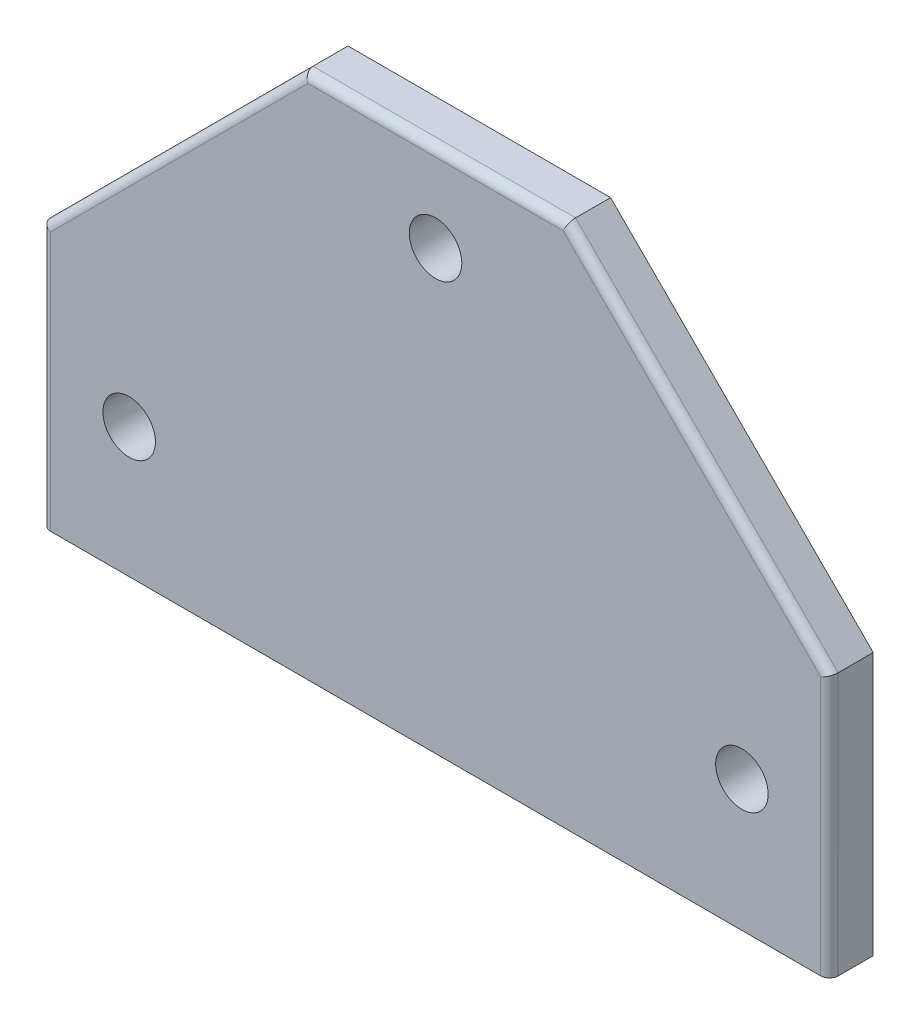
ISO-10303-21;
HEADER;
FILE_DESCRIPTION(('STEP AP214'),'2;1');
FILE_NAME('part.step','',(''),(''),'','','');
FILE_SCHEMA(('AUTOMOTIVE_DESIGN { 1 0 10303 214 1 1 1 1 }'));
ENDSEC;
DATA;
#1=APPLICATION_CONTEXT('core data for automotive mechanical design processes');
#2=APPLICATION_PROTOCOL_DEFINITION('international standard','automotive_design',2000,#1);
#3=PRODUCT_CONTEXT('',#1,'mechanical');
#4=PRODUCT('Part','Part','',(#3));
#5=PRODUCT_RELATED_PRODUCT_CATEGORY('part','',(#4));
#6=PRODUCT_DEFINITION_FORMATION('','',#4);
#7=PRODUCT_DEFINITION_CONTEXT('part definition',#1,'design');
#8=PRODUCT_DEFINITION('design','',#6,#7);
#9=PRODUCT_DEFINITION_SHAPE('','',#8);
#10=(LENGTH_UNIT() NAMED_UNIT(*) SI_UNIT(.MILLI.,.METRE.));
#11=(NAMED_UNIT(*) PLANE_ANGLE_UNIT() SI_UNIT($,.RADIAN.));
#12=(NAMED_UNIT(*) SI_UNIT($,.STERADIAN.) SOLID_ANGLE_UNIT());
#13=UNCERTAINTY_MEASURE_WITH_UNIT(LENGTH_MEASURE(1.E-05),#10,'distance_accuracy_value','');
#14=(GEOMETRIC_REPRESENTATION_CONTEXT(3) GLOBAL_UNCERTAINTY_ASSIGNED_CONTEXT((#13)) GLOBAL_UNIT_ASSIGNED_CONTEXT((#10,
#11,#12)) REPRESENTATION_CONTEXT('',''));
#15=CARTESIAN_POINT('',(0.,0.,0.));
#16=DIRECTION('',(0.,0.,1.));
#17=DIRECTION('',(1.,0.,0.));
#18=AXIS2_PLACEMENT_3D('',#15,#16,#17);
#19=CARTESIAN_POINT('',(0.,0.,6.35));
#20=DIRECTION('',(1.,0.,0.));
#21=DIRECTION('',(0.,0.,-1.));
#22=AXIS2_PLACEMENT_3D('',#19,#20,#21);
#23=PLANE('',#22);
#24=DIRECTION('',(0.,0.,-1.));
#25=VECTOR('',#24,1.);
#26=CARTESIAN_POINT('',(0.,0.,6.35));
#27=LINE('',#26,#25);
#28=CARTESIAN_POINT('',(0.,0.,5.08));
#29=VERTEX_POINT('',#28);
#30=CARTESIAN_POINT('',(0.,0.,0.));
#31=VERTEX_POINT('',#30);
#32=EDGE_CURVE('E112',#29,#31,#27,.T.);
#33=ORIENTED_EDGE('',*,*,#32,.F.);
#34=DIRECTION('',(0.,-1.,0.));
#35=VECTOR('',#34,1.);
#36=CARTESIAN_POINT('',(0.,0.,5.08));
#37=LINE('',#36,#35);
#38=CARTESIAN_POINT('',(0.,38.1,5.08));
#39=VERTEX_POINT('',#38);
#40=EDGE_CURVE('E65',#29,#39,#37,.F.);
#41=ORIENTED_EDGE('',*,*,#40,.T.);
#42=DIRECTION('',(0.,0.,-1.));
#43=VECTOR('',#42,1.);
#44=CARTESIAN_POINT('',(0.,38.1,6.35));
#45=LINE('',#44,#43);
#46=CARTESIAN_POINT('',(0.,38.1,0.));
#47=VERTEX_POINT('',#46);
#48=EDGE_CURVE('E134',#39,#47,#45,.T.);
#49=ORIENTED_EDGE('',*,*,#48,.T.);
#50=DIRECTION('',(0.,-1.,0.));
#51=VECTOR('',#50,1.);
#52=CARTESIAN_POINT('',(0.,0.,0.));
#53=LINE('',#52,#51);
#54=EDGE_CURVE('E129',#47,#31,#53,.T.);
#55=ORIENTED_EDGE('',*,*,#54,.T.);
#56=EDGE_LOOP('',(#33,#41,#49,#55));
#57=FACE_BOUND('',#56,.T.);
#58=ADVANCED_FACE('F41',(#57),#23,.F.);
#59=CARTESIAN_POINT('',(0.,0.,6.35));
#60=DIRECTION('',(0.,1.,0.));
#61=DIRECTION('',(0.,0.,1.));
#62=AXIS2_PLACEMENT_3D('',#59,#60,#61);
#63=PLANE('',#62);
#64=DIRECTION('',(0.,0.,-1.));
#65=VECTOR('',#64,1.);
#66=CARTESIAN_POINT('',(114.3,0.,6.35));
#67=LINE('',#66,#65);
#68=CARTESIAN_POINT('',(114.3,0.,5.08));
#69=VERTEX_POINT('',#68);
#70=CARTESIAN_POINT('',(114.3,0.,0.));
#71=VERTEX_POINT('',#70);
#72=EDGE_CURVE('E123',#69,#71,#67,.T.);
#73=ORIENTED_EDGE('',*,*,#72,.F.);
#74=CARTESIAN_POINT('',(113.03,0.,5.08));
#75=DIRECTION('',(0.,1.,0.));
#76=DIRECTION('',(0.,0.,1.));
#77=AXIS2_PLACEMENT_3D('',#74,#75,#76);
#78=CIRCLE('',#77,1.27);
#79=CARTESIAN_POINT('',(113.03,0.,6.35));
#80=VERTEX_POINT('',#79);
#81=EDGE_CURVE('E173',#69,#80,#78,.F.);
#82=ORIENTED_EDGE('',*,*,#81,.T.);
#83=DIRECTION('',(1.,0.,0.));
#84=VECTOR('',#83,1.);
#85=CARTESIAN_POINT('',(0.,0.,6.35));
#86=LINE('',#85,#84);
#87=CARTESIAN_POINT('',(1.27,0.,6.35));
#88=VERTEX_POINT('',#87);
#89=EDGE_CURVE('E140',#88,#80,#86,.T.);
#90=ORIENTED_EDGE('',*,*,#89,.F.);
#91=CARTESIAN_POINT('',(1.27,0.,5.08));
#92=DIRECTION('',(0.,1.,0.));
#93=DIRECTION('',(0.,0.,1.));
#94=AXIS2_PLACEMENT_3D('',#91,#92,#93);
#95=CIRCLE('',#94,1.27);
#96=EDGE_CURVE('E120',#88,#29,#95,.F.);
#97=ORIENTED_EDGE('',*,*,#96,.T.);
#98=ORIENTED_EDGE('',*,*,#32,.T.);
#99=DIRECTION('',(1.,0.,0.));
#100=VECTOR('',#99,1.);
#101=CARTESIAN_POINT('',(0.,0.,0.));
#102=LINE('',#101,#100);
#103=EDGE_CURVE('E116',#31,#71,#102,.T.);
#104=ORIENTED_EDGE('',*,*,#103,.T.);
#105=EDGE_LOOP('',(#73,#82,#90,#97,#98,#104));
#106=FACE_BOUND('',#105,.T.);
#107=ADVANCED_FACE('F115',(#106),#63,.F.);
#108=CARTESIAN_POINT('',(114.3,0.,6.35));
#109=DIRECTION('',(-1.,0.,0.));
#110=DIRECTION('',(0.,0.,1.));
#111=AXIS2_PLACEMENT_3D('',#108,#109,#110);
#112=PLANE('',#111);
#113=DIRECTION('',(0.,0.,-1.));
#114=VECTOR('',#113,1.);
#115=CARTESIAN_POINT('',(114.3,38.1,6.35));
#116=LINE('',#115,#114);
#117=CARTESIAN_POINT('',(114.3,38.1,5.08));
#118=VERTEX_POINT('',#117);
#119=CARTESIAN_POINT('',(114.3,38.1,0.));
#120=VERTEX_POINT('',#119);
#121=EDGE_CURVE('E157',#118,#120,#116,.T.);
#122=ORIENTED_EDGE('',*,*,#121,.F.);
#123=DIRECTION('',(0.,1.,0.));
#124=VECTOR('',#123,1.);
#125=CARTESIAN_POINT('',(114.3,0.,5.08));
#126=LINE('',#125,#124);
#127=EDGE_CURVE('E170',#118,#69,#126,.F.);
#128=ORIENTED_EDGE('',*,*,#127,.T.);
#129=ORIENTED_EDGE('',*,*,#72,.T.);
#130=DIRECTION('',(0.,1.,0.));
#131=VECTOR('',#130,1.);
#132=CARTESIAN_POINT('',(114.3,0.,0.));
#133=LINE('',#132,#131);
#134=EDGE_CURVE('E132',#71,#120,#133,.T.);
#135=ORIENTED_EDGE('',*,*,#134,.T.);
#136=EDGE_LOOP('',(#122,#128,#129,#135));
#137=FACE_BOUND('',#136,.T.);
#138=ADVANCED_FACE('F213',(#137),#112,.F.);
#139=CARTESIAN_POINT('',(76.2,76.2,6.35));
#140=DIRECTION('',(-0.707106781186548,-0.707106781186547,0.));
#141=DIRECTION('',(0.707106781186547,-0.707106781186548,0.));
#142=AXIS2_PLACEMENT_3D('',#139,#140,#141);
#143=PLANE('',#142);
#144=DIRECTION('',(0.,0.,-1.));
#145=VECTOR('',#144,1.);
#146=CARTESIAN_POINT('',(76.2,76.2,6.35));
#147=LINE('',#146,#145);
#148=CARTESIAN_POINT('',(76.2,76.2,5.08));
#149=VERTEX_POINT('',#148);
#150=CARTESIAN_POINT('',(76.2,76.2,0.));
#151=VERTEX_POINT('',#150);
#152=EDGE_CURVE('E155',#149,#151,#147,.T.);
#153=ORIENTED_EDGE('',*,*,#152,.F.);
#154=DIRECTION('',(-0.707106781186547,0.707106781186548,0.));
#155=VECTOR('',#154,1.);
#156=CARTESIAN_POINT('',(76.2,76.2,5.08));
#157=LINE('',#156,#155);
#158=EDGE_CURVE('E175',#149,#118,#157,.F.);
#159=ORIENTED_EDGE('',*,*,#158,.T.);
#160=ORIENTED_EDGE('',*,*,#121,.T.);
#161=DIRECTION('',(-0.707106781186547,0.707106781186548,0.));
#162=VECTOR('',#161,1.);
#163=CARTESIAN_POINT('',(76.2,76.2,0.));
#164=LINE('',#163,#162);
#165=EDGE_CURVE('E144',#120,#151,#164,.T.);
#166=ORIENTED_EDGE('',*,*,#165,.T.);
#167=EDGE_LOOP('',(#153,#159,#160,#166));
#168=FACE_BOUND('',#167,.T.);
#169=ADVANCED_FACE('F312',(#168),#143,.F.);
#170=CARTESIAN_POINT('',(38.1,76.2,6.35));
#171=DIRECTION('',(0.,-1.,0.));
#172=DIRECTION('',(0.,0.,-1.));
#173=AXIS2_PLACEMENT_3D('',#170,#171,#172);
#174=PLANE('',#173);
#175=DIRECTION('',(0.,0.,-1.));
#176=VECTOR('',#175,1.);
#177=CARTESIAN_POINT('',(38.1,76.2,6.35));
#178=LINE('',#177,#176);
#179=CARTESIAN_POINT('',(38.1,76.2,5.08));
#180=VERTEX_POINT('',#179);
#181=CARTESIAN_POINT('',(38.1,76.2,0.));
#182=VERTEX_POINT('',#181);
#183=EDGE_CURVE('E153',#180,#182,#178,.T.);
#184=ORIENTED_EDGE('',*,*,#183,.F.);
#185=DIRECTION('',(-1.,0.,0.));
#186=VECTOR('',#185,1.);
#187=CARTESIAN_POINT('',(38.1,76.2,5.08));
#188=LINE('',#187,#186);
#189=EDGE_CURVE('E11',#180,#149,#188,.F.);
#190=ORIENTED_EDGE('',*,*,#189,.T.);
#191=ORIENTED_EDGE('',*,*,#152,.T.);
#192=DIRECTION('',(-1.,0.,0.));
#193=VECTOR('',#192,1.);
#194=CARTESIAN_POINT('',(38.1,76.2,0.));
#195=LINE('',#194,#193);
#196=EDGE_CURVE('E147',#151,#182,#195,.T.);
#197=ORIENTED_EDGE('',*,*,#196,.T.);
#198=EDGE_LOOP('',(#184,#190,#191,#197));
#199=FACE_BOUND('',#198,.T.);
#200=ADVANCED_FACE('F304',(#199),#174,.F.);
#201=CARTESIAN_POINT('',(0.,38.1,6.35));
#202=DIRECTION('',(0.707106781186548,-0.707106781186548,0.));
#203=DIRECTION('',(0.707106781186548,0.707106781186548,0.));
#204=AXIS2_PLACEMENT_3D('',#201,#202,#203);
#205=PLANE('',#204);
#206=ORIENTED_EDGE('',*,*,#48,.F.);
#207=DIRECTION('',(-0.707106781186548,-0.707106781186548,0.));
#208=VECTOR('',#207,1.);
#209=CARTESIAN_POINT('',(0.,38.1,5.08));
#210=LINE('',#209,#208);
#211=EDGE_CURVE('E50',#39,#180,#210,.F.);
#212=ORIENTED_EDGE('',*,*,#211,.T.);
#213=ORIENTED_EDGE('',*,*,#183,.T.);
#214=DIRECTION('',(-0.707106781186547,-0.707106781186547,0.));
#215=VECTOR('',#214,1.);
#216=CARTESIAN_POINT('',(0.,38.1,0.));
#217=LINE('',#216,#215);
#218=EDGE_CURVE('E150',#182,#47,#217,.T.);
#219=ORIENTED_EDGE('',*,*,#218,.T.);
#220=EDGE_LOOP('',(#206,#212,#213,#219));
#221=FACE_BOUND('',#220,.T.);
#222=ADVANCED_FACE('F248',(#221),#205,.F.);
#223=CARTESIAN_POINT('',(0.,0.,6.35));
#224=DIRECTION('',(0.,0.,-1.));
#225=DIRECTION('',(-1.,0.,0.));
#226=AXIS2_PLACEMENT_3D('',#223,#224,#225);
#227=PLANE('',#226);
#228=CARTESIAN_POINT('',(12.7,18.8135724834994,6.35));
#229=DIRECTION('',(0.,0.,1.));
#230=DIRECTION('',(1.,0.,0.));
#231=AXIS2_PLACEMENT_3D('',#228,#229,#230);
#232=CIRCLE('',#231,3.81);
#233=CARTESIAN_POINT('',(16.51,18.8135724834994,6.35));
#234=VERTEX_POINT('',#233);
#235=EDGE_CURVE('E357',#234,#234,#232,.T.);
#236=ORIENTED_EDGE('',*,*,#235,.F.);
#237=EDGE_LOOP('',(#236));
#238=FACE_BOUND('',#237,.T.);
#239=CARTESIAN_POINT('',(101.6,19.0204465604374,6.35));
#240=DIRECTION('',(0.,0.,1.));
#241=DIRECTION('',(1.,0.,0.));
#242=AXIS2_PLACEMENT_3D('',#239,#240,#241);
#243=CIRCLE('',#242,3.81);
#244=CARTESIAN_POINT('',(105.41,19.0204465604374,6.35));
#245=VERTEX_POINT('',#244);
#246=EDGE_CURVE('E361',#245,#245,#243,.T.);
#247=ORIENTED_EDGE('',*,*,#246,.F.);
#248=EDGE_LOOP('',(#247));
#249=FACE_BOUND('',#248,.T.);
#250=CARTESIAN_POINT('',(57.15,63.5,6.35));
#251=DIRECTION('',(0.,0.,1.));
#252=DIRECTION('',(1.,0.,0.));
#253=AXIS2_PLACEMENT_3D('',#250,#251,#252);
#254=CIRCLE('',#253,3.81);
#255=CARTESIAN_POINT('',(60.96,63.5,6.35));
#256=VERTEX_POINT('',#255);
#257=EDGE_CURVE('E367',#256,#256,#254,.T.);
#258=ORIENTED_EDGE('',*,*,#257,.F.);
#259=EDGE_LOOP('',(#258));
#260=FACE_BOUND('',#259,.T.);
#261=ORIENTED_EDGE('',*,*,#89,.T.);
#262=DIRECTION('',(0.,1.,0.));
#263=VECTOR('',#262,1.);
#264=CARTESIAN_POINT('',(113.03,0.,6.35));
#265=LINE('',#264,#263);
#266=CARTESIAN_POINT('',(113.03,37.5739487757862,6.35));
#267=VERTEX_POINT('',#266);
#268=EDGE_CURVE('E167',#80,#267,#265,.T.);
#269=ORIENTED_EDGE('',*,*,#268,.T.);
#270=DIRECTION('',(-0.707106781186547,0.707106781186548,0.));
#271=VECTOR('',#270,1.);
#272=CARTESIAN_POINT('',(75.3019743878931,75.3019743878931,6.35));
#273=LINE('',#272,#271);
#274=CARTESIAN_POINT('',(75.6739487757862,74.93,6.35));
#275=VERTEX_POINT('',#274);
#276=EDGE_CURVE('E165',#267,#275,#273,.T.);
#277=ORIENTED_EDGE('',*,*,#276,.T.);
#278=DIRECTION('',(-1.,0.,0.));
#279=VECTOR('',#278,1.);
#280=CARTESIAN_POINT('',(0.,74.93,6.35));
#281=LINE('',#280,#279);
#282=CARTESIAN_POINT('',(38.6260512242139,74.93,6.35));
#283=VERTEX_POINT('',#282);
#284=EDGE_CURVE('E122',#275,#283,#281,.T.);
#285=ORIENTED_EDGE('',*,*,#284,.T.);
#286=DIRECTION('',(-0.707106781186548,-0.707106781186548,0.));
#287=VECTOR('',#286,1.);
#288=CARTESIAN_POINT('',(-18.1519743878931,18.1519743878931,6.35));
#289=LINE('',#288,#287);
#290=CARTESIAN_POINT('',(1.27,37.5739487757862,6.35));
#291=VERTEX_POINT('',#290);
#292=EDGE_CURVE('E161',#283,#291,#289,.T.);
#293=ORIENTED_EDGE('',*,*,#292,.T.);
#294=DIRECTION('',(0.,-1.,0.));
#295=VECTOR('',#294,1.);
#296=CARTESIAN_POINT('',(1.27,0.,6.35));
#297=LINE('',#296,#295);
#298=EDGE_CURVE('E163',#291,#88,#297,.T.);
#299=ORIENTED_EDGE('',*,*,#298,.T.);
#300=EDGE_LOOP('',(#261,#269,#277,#285,#293,#299));
#301=FACE_BOUND('',#300,.T.);
#302=ADVANCED_FACE('F198',(#238,#249,#260,#301),#227,.F.);
#303=CARTESIAN_POINT('',(0.,0.,0.));
#304=DIRECTION('',(0.,0.,-1.));
#305=DIRECTION('',(-1.,0.,0.));
#306=AXIS2_PLACEMENT_3D('',#303,#304,#305);
#307=PLANE('',#306);
#308=CARTESIAN_POINT('',(12.7,18.8135724834994,0.));
#309=DIRECTION('',(0.,0.,-1.));
#310=DIRECTION('',(-1.,0.,0.));
#311=AXIS2_PLACEMENT_3D('',#308,#309,#310);
#312=CIRCLE('',#311,3.81);
#313=CARTESIAN_POINT('',(8.89,18.8135724834994,0.));
#314=VERTEX_POINT('',#313);
#315=EDGE_CURVE('E182',#314,#314,#312,.F.);
#316=ORIENTED_EDGE('',*,*,#315,.T.);
#317=EDGE_LOOP('',(#316));
#318=FACE_BOUND('',#317,.T.);
#319=CARTESIAN_POINT('',(101.6,19.0204465604374,0.));
#320=DIRECTION('',(0.,0.,-1.));
#321=DIRECTION('',(-1.,0.,0.));
#322=AXIS2_PLACEMENT_3D('',#319,#320,#321);
#323=CIRCLE('',#322,3.81);
#324=CARTESIAN_POINT('',(97.79,19.0204465604374,0.));
#325=VERTEX_POINT('',#324);
#326=EDGE_CURVE('E364',#325,#325,#323,.F.);
#327=ORIENTED_EDGE('',*,*,#326,.T.);
#328=EDGE_LOOP('',(#327));
#329=FACE_BOUND('',#328,.T.);
#330=CARTESIAN_POINT('',(57.15,63.5,0.));
#331=DIRECTION('',(0.,0.,-1.));
#332=DIRECTION('',(-1.,0.,0.));
#333=AXIS2_PLACEMENT_3D('',#330,#331,#332);
#334=CIRCLE('',#333,3.81);
#335=CARTESIAN_POINT('',(53.34,63.5,0.));
#336=VERTEX_POINT('',#335);
#337=EDGE_CURVE('E370',#336,#336,#334,.F.);
#338=ORIENTED_EDGE('',*,*,#337,.T.);
#339=EDGE_LOOP('',(#338));
#340=FACE_BOUND('',#339,.T.);
#341=ORIENTED_EDGE('',*,*,#54,.F.);
#342=ORIENTED_EDGE('',*,*,#218,.F.);
#343=ORIENTED_EDGE('',*,*,#196,.F.);
#344=ORIENTED_EDGE('',*,*,#165,.F.);
#345=ORIENTED_EDGE('',*,*,#134,.F.);
#346=ORIENTED_EDGE('',*,*,#103,.F.);
#347=EDGE_LOOP('',(#341,#342,#343,#344,#345,#346));
#348=FACE_BOUND('',#347,.T.);
#349=ADVANCED_FACE('F127',(#318,#329,#340,#348),#307,.T.);
#350=CARTESIAN_POINT('',(1.27,0.,5.08));
#351=DIRECTION('',(0.,-1.,0.));
#352=DIRECTION('',(0.,0.,-1.));
#353=AXIS2_PLACEMENT_3D('',#350,#351,#352);
#354=CYLINDRICAL_SURFACE('',#353,1.27);
#355=ORIENTED_EDGE('',*,*,#96,.F.);
#356=ORIENTED_EDGE('',*,*,#298,.F.);
#357=CARTESIAN_POINT('',(1.27,37.5739487757862,5.08));
#358=DIRECTION('',(-0.38268343236509,-0.923879532511287,0.));
#359=DIRECTION('',(-0.923879532511287,0.38268343236509,0.));
#360=AXIS2_PLACEMENT_3D('',#357,#358,#359);
#361=ELLIPSE('',#360,1.37463809437134,1.27);
#362=EDGE_CURVE('E45',#39,#291,#361,.F.);
#363=ORIENTED_EDGE('',*,*,#362,.F.);
#364=ORIENTED_EDGE('',*,*,#40,.F.);
#365=EDGE_LOOP('',(#355,#356,#363,#364));
#366=FACE_BOUND('',#365,.T.);
#367=ADVANCED_FACE('F43',(#366),#354,.T.);
#368=CARTESIAN_POINT('',(-18.1519743878931,18.1519743878931,5.08));
#369=DIRECTION('',(-0.707106781186548,-0.707106781186548,0.));
#370=DIRECTION('',(0.707106781186548,-0.707106781186548,0.));
#371=AXIS2_PLACEMENT_3D('',#368,#369,#370);
#372=CYLINDRICAL_SURFACE('',#371,1.27);
#373=ORIENTED_EDGE('',*,*,#362,.T.);
#374=ORIENTED_EDGE('',*,*,#292,.F.);
#375=CARTESIAN_POINT('',(38.6260512242139,74.93,5.08));
#376=DIRECTION('',(-0.923879532511287,-0.38268343236509,0.));
#377=DIRECTION('',(-0.38268343236509,0.923879532511287,0.));
#378=AXIS2_PLACEMENT_3D('',#375,#376,#377);
#379=ELLIPSE('',#378,1.37463809437134,1.27);
#380=EDGE_CURVE('E138',#180,#283,#379,.F.);
#381=ORIENTED_EDGE('',*,*,#380,.F.);
#382=ORIENTED_EDGE('',*,*,#211,.F.);
#383=EDGE_LOOP('',(#373,#374,#381,#382));
#384=FACE_BOUND('',#383,.T.);
#385=ADVANCED_FACE('F193',(#384),#372,.T.);
#386=CARTESIAN_POINT('',(0.,74.93,5.08));
#387=DIRECTION('',(-1.,0.,0.));
#388=DIRECTION('',(0.,0.,1.));
#389=AXIS2_PLACEMENT_3D('',#386,#387,#388);
#390=CYLINDRICAL_SURFACE('',#389,1.27);
#391=ORIENTED_EDGE('',*,*,#380,.T.);
#392=ORIENTED_EDGE('',*,*,#284,.F.);
#393=CARTESIAN_POINT('',(75.6739487757862,74.93,5.08));
#394=DIRECTION('',(-0.923879532511287,0.38268343236509,0.));
#395=DIRECTION('',(-0.38268343236509,-0.923879532511287,0.));
#396=AXIS2_PLACEMENT_3D('',#393,#394,#395);
#397=ELLIPSE('',#396,1.37463809437134,1.27);
#398=EDGE_CURVE('E181',#149,#275,#397,.F.);
#399=ORIENTED_EDGE('',*,*,#398,.F.);
#400=ORIENTED_EDGE('',*,*,#189,.F.);
#401=EDGE_LOOP('',(#391,#392,#399,#400));
#402=FACE_BOUND('',#401,.T.);
#403=ADVANCED_FACE('F189',(#402),#390,.T.);
#404=CARTESIAN_POINT('',(75.3019743878931,75.3019743878931,5.08));
#405=DIRECTION('',(-0.707106781186547,0.707106781186548,0.));
#406=DIRECTION('',(-0.707106781186548,-0.707106781186547,0.));
#407=AXIS2_PLACEMENT_3D('',#404,#405,#406);
#408=CYLINDRICAL_SURFACE('',#407,1.27);
#409=ORIENTED_EDGE('',*,*,#398,.T.);
#410=ORIENTED_EDGE('',*,*,#276,.F.);
#411=CARTESIAN_POINT('',(113.03,37.5739487757862,5.08));
#412=DIRECTION('',(-0.38268343236509,0.923879532511287,0.));
#413=DIRECTION('',(-0.923879532511287,-0.38268343236509,0.));
#414=AXIS2_PLACEMENT_3D('',#411,#412,#413);
#415=ELLIPSE('',#414,1.37463809437134,1.27);
#416=EDGE_CURVE('E179',#118,#267,#415,.F.);
#417=ORIENTED_EDGE('',*,*,#416,.F.);
#418=ORIENTED_EDGE('',*,*,#158,.F.);
#419=EDGE_LOOP('',(#409,#410,#417,#418));
#420=FACE_BOUND('',#419,.T.);
#421=ADVANCED_FACE('F221',(#420),#408,.T.);
#422=CARTESIAN_POINT('',(113.03,0.,5.08));
#423=DIRECTION('',(0.,1.,0.));
#424=DIRECTION('',(0.,0.,1.));
#425=AXIS2_PLACEMENT_3D('',#422,#423,#424);
#426=CYLINDRICAL_SURFACE('',#425,1.27);
#427=ORIENTED_EDGE('',*,*,#81,.F.);
#428=ORIENTED_EDGE('',*,*,#127,.F.);
#429=ORIENTED_EDGE('',*,*,#416,.T.);
#430=ORIENTED_EDGE('',*,*,#268,.F.);
#431=EDGE_LOOP('',(#427,#428,#429,#430));
#432=FACE_BOUND('',#431,.T.);
#433=ADVANCED_FACE('F217',(#432),#426,.T.);
#434=CARTESIAN_POINT('',(57.15,63.5,-10.776307345283));
#435=DIRECTION('',(0.,0.,1.));
#436=DIRECTION('',(1.,0.,0.));
#437=AXIS2_PLACEMENT_3D('',#434,#435,#436);
#438=CYLINDRICAL_SURFACE('',#437,3.81);
#439=ORIENTED_EDGE('',*,*,#257,.T.);
#440=EDGE_LOOP('',(#439));
#441=FACE_BOUND('',#440,.T.);
#442=ORIENTED_EDGE('',*,*,#337,.F.);
#443=EDGE_LOOP('',(#442));
#444=FACE_BOUND('',#443,.T.);
#445=ADVANCED_FACE('F220',(#441,#444),#438,.F.);
#446=CARTESIAN_POINT('',(101.6,19.0204465604374,-10.776307345283));
#447=DIRECTION('',(0.,0.,1.));
#448=DIRECTION('',(1.,0.,0.));
#449=AXIS2_PLACEMENT_3D('',#446,#447,#448);
#450=CYLINDRICAL_SURFACE('',#449,3.81);
#451=ORIENTED_EDGE('',*,*,#246,.T.);
#452=EDGE_LOOP('',(#451));
#453=FACE_BOUND('',#452,.T.);
#454=ORIENTED_EDGE('',*,*,#326,.F.);
#455=EDGE_LOOP('',(#454));
#456=FACE_BOUND('',#455,.T.);
#457=ADVANCED_FACE('F263',(#453,#456),#450,.F.);
#458=CARTESIAN_POINT('',(12.7,18.8135724834994,-10.776307345283));
#459=DIRECTION('',(0.,0.,1.));
#460=DIRECTION('',(1.,0.,0.));
#461=AXIS2_PLACEMENT_3D('',#458,#459,#460);
#462=CYLINDRICAL_SURFACE('',#461,3.81);
#463=ORIENTED_EDGE('',*,*,#235,.T.);
#464=EDGE_LOOP('',(#463));
#465=FACE_BOUND('',#464,.T.);
#466=ORIENTED_EDGE('',*,*,#315,.F.);
#467=EDGE_LOOP('',(#466));
#468=FACE_BOUND('',#467,.T.);
#469=ADVANCED_FACE('F272',(#465,#468),#462,.F.);
#470=CLOSED_SHELL('',(#58,#107,#138,#169,#200,#222,#302,#349,#367,#385,#403,#421,#433,#445,#457,#469));
#471=MANIFOLD_SOLID_BREP('B2',#470);
#472=ADVANCED_BREP_SHAPE_REPRESENTATION('',(#18,#471),#14);
#473=SHAPE_DEFINITION_REPRESENTATION(#9,#472);
ENDSEC;
END-ISO-10303-21;
